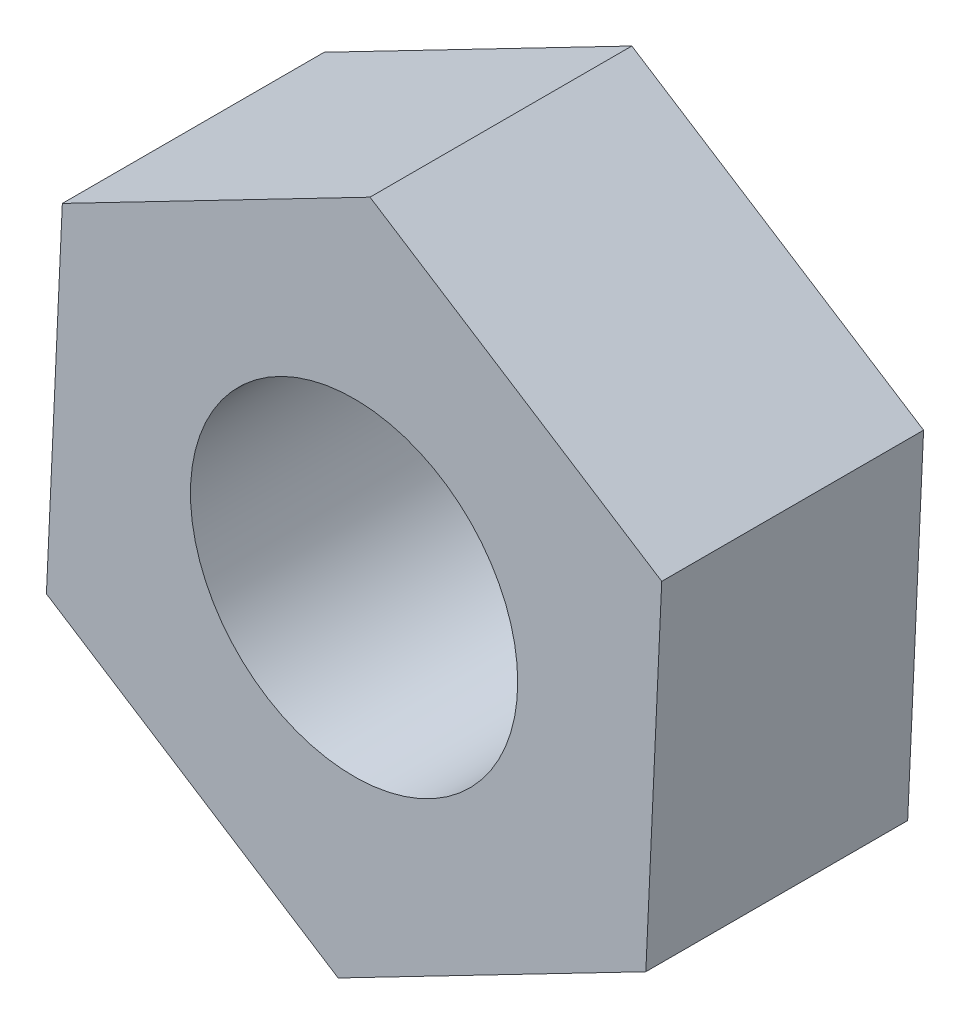
ISO-10303-21;
HEADER;
FILE_DESCRIPTION(('STEP AP214'),'2;1');
FILE_NAME('part.step','',(''),(''),'','','');
FILE_SCHEMA(('AUTOMOTIVE_DESIGN { 1 0 10303 214 1 1 1 1 }'));
ENDSEC;
DATA;
#1=APPLICATION_CONTEXT('core data for automotive mechanical design processes');
#2=APPLICATION_PROTOCOL_DEFINITION('international standard','automotive_design',2000,#1);
#3=PRODUCT_CONTEXT('',#1,'mechanical');
#4=PRODUCT('Part','Part','',(#3));
#5=PRODUCT_RELATED_PRODUCT_CATEGORY('part','',(#4));
#6=PRODUCT_DEFINITION_FORMATION('','',#4);
#7=PRODUCT_DEFINITION_CONTEXT('part definition',#1,'design');
#8=PRODUCT_DEFINITION('design','',#6,#7);
#9=PRODUCT_DEFINITION_SHAPE('','',#8);
#10=(LENGTH_UNIT() NAMED_UNIT(*) SI_UNIT(.MILLI.,.METRE.));
#11=(NAMED_UNIT(*) PLANE_ANGLE_UNIT() SI_UNIT($,.RADIAN.));
#12=(NAMED_UNIT(*) SI_UNIT($,.STERADIAN.) SOLID_ANGLE_UNIT());
#13=UNCERTAINTY_MEASURE_WITH_UNIT(LENGTH_MEASURE(1.E-05),#10,'distance_accuracy_value','');
#14=(GEOMETRIC_REPRESENTATION_CONTEXT(3) GLOBAL_UNCERTAINTY_ASSIGNED_CONTEXT((#13)) GLOBAL_UNIT_ASSIGNED_CONTEXT((#10,
#11,#12)) REPRESENTATION_CONTEXT('',''));
#15=CARTESIAN_POINT('',(0.,0.,0.));
#16=DIRECTION('',(0.,0.,1.));
#17=DIRECTION('',(1.,0.,0.));
#18=AXIS2_PLACEMENT_3D('',#15,#16,#17);
#19=CARTESIAN_POINT('',(0.,0.,2.4));
#20=DIRECTION('',(0.,0.,1.));
#21=DIRECTION('',(1.,0.,0.));
#22=AXIS2_PLACEMENT_3D('',#19,#20,#21);
#23=PLANE('',#22);
#24=DIRECTION('',(-0.0459498793532353,-0.998943746457939,0.));
#25=VECTOR('',#24,1.);
#26=CARTESIAN_POINT('',(-2.67414007092132,1.71239838075906,2.4));
#27=LINE('',#26,#25);
#28=CARTESIAN_POINT('',(-2.67414007092132,1.71239838075906,2.4));
#29=VERTEX_POINT('',#28);
#30=CARTESIAN_POINT('',(-2.82005053459734,-1.45967404431626,2.4));
#31=VERTEX_POINT('',#30);
#32=EDGE_CURVE('E130',#29,#31,#27,.T.);
#33=ORIENTED_EDGE('',*,*,#32,.T.);
#34=DIRECTION('',(0.842135721707559,-0.539265636049701,0.));
#35=VECTOR('',#34,1.);
#36=CARTESIAN_POINT('',(-2.82005053459734,-1.45967404431626,2.4));
#37=LINE('',#36,#35);
#38=CARTESIAN_POINT('',(-0.145910463676016,-3.17207242507531,2.4));
#39=VERTEX_POINT('',#38);
#40=EDGE_CURVE('E88',#31,#39,#37,.T.);
#41=ORIENTED_EDGE('',*,*,#40,.T.);
#42=DIRECTION('',(0.888085601060794,0.459678110408237,0.));
#43=VECTOR('',#42,1.);
#44=CARTESIAN_POINT('',(-0.145910463676016,-3.17207242507531,2.4));
#45=LINE('',#44,#43);
#46=CARTESIAN_POINT('',(2.67414007092132,-1.71239838075906,2.4));
#47=VERTEX_POINT('',#46);
#48=EDGE_CURVE('E101',#39,#47,#45,.T.);
#49=ORIENTED_EDGE('',*,*,#48,.T.);
#50=DIRECTION('',(0.0459498793532356,0.998943746457939,0.));
#51=VECTOR('',#50,1.);
#52=CARTESIAN_POINT('',(2.67414007092132,-1.71239838075906,2.4));
#53=LINE('',#52,#51);
#54=CARTESIAN_POINT('',(2.82005053459734,1.45967404431626,2.4));
#55=VERTEX_POINT('',#54);
#56=EDGE_CURVE('E95',#47,#55,#53,.T.);
#57=ORIENTED_EDGE('',*,*,#56,.T.);
#58=DIRECTION('',(-0.842135721707559,0.539265636049702,0.));
#59=VECTOR('',#58,1.);
#60=CARTESIAN_POINT('',(2.82005053459734,1.45967404431626,2.4));
#61=LINE('',#60,#59);
#62=CARTESIAN_POINT('',(0.145910463676018,3.17207242507531,2.4));
#63=VERTEX_POINT('',#62);
#64=EDGE_CURVE('E99',#55,#63,#61,.T.);
#65=ORIENTED_EDGE('',*,*,#64,.T.);
#66=DIRECTION('',(-0.888085601060795,-0.459678110408237,0.));
#67=VECTOR('',#66,1.);
#68=CARTESIAN_POINT('',(0.145910463676018,3.17207242507531,2.4));
#69=LINE('',#68,#67);
#70=EDGE_CURVE('E51',#63,#29,#69,.T.);
#71=ORIENTED_EDGE('',*,*,#70,.T.);
#72=EDGE_LOOP('',(#33,#41,#49,#57,#65,#71));
#73=FACE_BOUND('',#72,.T.);
#74=CARTESIAN_POINT('',(0.,0.,2.4));
#75=DIRECTION('',(0.,0.,1.));
#76=DIRECTION('',(1.,0.,0.));
#77=AXIS2_PLACEMENT_3D('',#74,#75,#76);
#78=CIRCLE('',#77,1.5);
#79=CARTESIAN_POINT('',(1.5,0.,2.4));
#80=VERTEX_POINT('',#79);
#81=EDGE_CURVE('E123',#80,#80,#78,.T.);
#82=ORIENTED_EDGE('',*,*,#81,.F.);
#83=EDGE_LOOP('',(#82));
#84=FACE_BOUND('',#83,.T.);
#85=ADVANCED_FACE('F34',(#73,#84),#23,.T.);
#86=CARTESIAN_POINT('',(0.,0.,0.));
#87=DIRECTION('',(0.,0.,1.));
#88=DIRECTION('',(1.,0.,0.));
#89=AXIS2_PLACEMENT_3D('',#86,#87,#88);
#90=PLANE('',#89);
#91=DIRECTION('',(-0.0459498793532353,-0.998943746457939,0.));
#92=VECTOR('',#91,1.);
#93=CARTESIAN_POINT('',(-2.67414007092132,1.71239838075906,0.));
#94=LINE('',#93,#92);
#95=CARTESIAN_POINT('',(-2.67414007092132,1.71239838075906,0.));
#96=VERTEX_POINT('',#95);
#97=CARTESIAN_POINT('',(-2.82005053459734,-1.45967404431626,0.));
#98=VERTEX_POINT('',#97);
#99=EDGE_CURVE('E119',#96,#98,#94,.T.);
#100=ORIENTED_EDGE('',*,*,#99,.F.);
#101=DIRECTION('',(-0.888085601060795,-0.459678110408237,0.));
#102=VECTOR('',#101,1.);
#103=CARTESIAN_POINT('',(0.145910463676018,3.17207242507531,0.));
#104=LINE('',#103,#102);
#105=CARTESIAN_POINT('',(0.145910463676018,3.17207242507531,0.));
#106=VERTEX_POINT('',#105);
#107=EDGE_CURVE('E80',#106,#96,#104,.T.);
#108=ORIENTED_EDGE('',*,*,#107,.F.);
#109=DIRECTION('',(-0.842135721707559,0.539265636049702,0.));
#110=VECTOR('',#109,1.);
#111=CARTESIAN_POINT('',(2.82005053459734,1.45967404431626,0.));
#112=LINE('',#111,#110);
#113=CARTESIAN_POINT('',(2.82005053459734,1.45967404431626,0.));
#114=VERTEX_POINT('',#113);
#115=EDGE_CURVE('E74',#114,#106,#112,.T.);
#116=ORIENTED_EDGE('',*,*,#115,.F.);
#117=DIRECTION('',(0.0459498793532356,0.998943746457939,0.));
#118=VECTOR('',#117,1.);
#119=CARTESIAN_POINT('',(2.67414007092132,-1.71239838075906,0.));
#120=LINE('',#119,#118);
#121=CARTESIAN_POINT('',(2.67414007092132,-1.71239838075906,0.));
#122=VERTEX_POINT('',#121);
#123=EDGE_CURVE('E109',#122,#114,#120,.T.);
#124=ORIENTED_EDGE('',*,*,#123,.F.);
#125=DIRECTION('',(0.888085601060794,0.459678110408237,0.));
#126=VECTOR('',#125,1.);
#127=CARTESIAN_POINT('',(-0.145910463676016,-3.17207242507531,0.));
#128=LINE('',#127,#126);
#129=CARTESIAN_POINT('',(-0.145910463676016,-3.17207242507531,0.));
#130=VERTEX_POINT('',#129);
#131=EDGE_CURVE('E125',#130,#122,#128,.T.);
#132=ORIENTED_EDGE('',*,*,#131,.F.);
#133=DIRECTION('',(0.842135721707559,-0.539265636049701,0.));
#134=VECTOR('',#133,1.);
#135=CARTESIAN_POINT('',(-2.82005053459734,-1.45967404431626,0.));
#136=LINE('',#135,#134);
#137=EDGE_CURVE('E122',#98,#130,#136,.T.);
#138=ORIENTED_EDGE('',*,*,#137,.F.);
#139=EDGE_LOOP('',(#100,#108,#116,#124,#132,#138));
#140=FACE_BOUND('',#139,.T.);
#141=CARTESIAN_POINT('',(0.,0.,0.));
#142=DIRECTION('',(0.,0.,1.));
#143=DIRECTION('',(1.,0.,0.));
#144=AXIS2_PLACEMENT_3D('',#141,#142,#143);
#145=CIRCLE('',#144,1.5);
#146=CARTESIAN_POINT('',(1.5,0.,0.));
#147=VERTEX_POINT('',#146);
#148=EDGE_CURVE('E223',#147,#147,#145,.T.);
#149=ORIENTED_EDGE('',*,*,#148,.T.);
#150=EDGE_LOOP('',(#149));
#151=FACE_BOUND('',#150,.T.);
#152=ADVANCED_FACE('F139',(#140,#151),#90,.F.);
#153=CARTESIAN_POINT('',(-2.67414007092132,1.71239838075906,2.4));
#154=DIRECTION('',(0.998943746457939,-0.0459498793532353,0.));
#155=DIRECTION('',(0.0459498793532353,0.998943746457939,0.));
#156=AXIS2_PLACEMENT_3D('',#153,#154,#155);
#157=PLANE('',#156);
#158=ORIENTED_EDGE('',*,*,#99,.T.);
#159=DIRECTION('',(0.,0.,-1.));
#160=VECTOR('',#159,1.);
#161=CARTESIAN_POINT('',(-2.82005053459734,-1.45967404431626,2.4));
#162=LINE('',#161,#160);
#163=EDGE_CURVE('E11',#31,#98,#162,.T.);
#164=ORIENTED_EDGE('',*,*,#163,.F.);
#165=ORIENTED_EDGE('',*,*,#32,.F.);
#166=DIRECTION('',(0.,0.,-1.));
#167=VECTOR('',#166,1.);
#168=CARTESIAN_POINT('',(-2.67414007092132,1.71239838075906,2.4));
#169=LINE('',#168,#167);
#170=EDGE_CURVE('E115',#29,#96,#169,.T.);
#171=ORIENTED_EDGE('',*,*,#170,.T.);
#172=EDGE_LOOP('',(#158,#164,#165,#171));
#173=FACE_BOUND('',#172,.T.);
#174=ADVANCED_FACE('F36',(#173),#157,.F.);
#175=CARTESIAN_POINT('',(-2.82005053459734,-1.45967404431626,2.4));
#176=DIRECTION('',(0.539265636049701,0.842135721707559,0.));
#177=DIRECTION('',(-0.842135721707559,0.539265636049701,0.));
#178=AXIS2_PLACEMENT_3D('',#175,#176,#177);
#179=PLANE('',#178);
#180=ORIENTED_EDGE('',*,*,#137,.T.);
#181=DIRECTION('',(0.,0.,-1.));
#182=VECTOR('',#181,1.);
#183=CARTESIAN_POINT('',(-0.145910463676016,-3.17207242507531,2.4));
#184=LINE('',#183,#182);
#185=EDGE_CURVE('E43',#39,#130,#184,.T.);
#186=ORIENTED_EDGE('',*,*,#185,.F.);
#187=ORIENTED_EDGE('',*,*,#40,.F.);
#188=ORIENTED_EDGE('',*,*,#163,.T.);
#189=EDGE_LOOP('',(#180,#186,#187,#188));
#190=FACE_BOUND('',#189,.T.);
#191=ADVANCED_FACE('F164',(#190),#179,.F.);
#192=CARTESIAN_POINT('',(-0.145910463676016,-3.17207242507531,2.4));
#193=DIRECTION('',(-0.459678110408237,0.888085601060794,0.));
#194=DIRECTION('',(-0.888085601060795,-0.459678110408237,0.));
#195=AXIS2_PLACEMENT_3D('',#192,#193,#194);
#196=PLANE('',#195);
#197=ORIENTED_EDGE('',*,*,#131,.T.);
#198=DIRECTION('',(0.,0.,-1.));
#199=VECTOR('',#198,1.);
#200=CARTESIAN_POINT('',(2.67414007092132,-1.71239838075906,2.4));
#201=LINE('',#200,#199);
#202=EDGE_CURVE('E110',#47,#122,#201,.T.);
#203=ORIENTED_EDGE('',*,*,#202,.F.);
#204=ORIENTED_EDGE('',*,*,#48,.F.);
#205=ORIENTED_EDGE('',*,*,#185,.T.);
#206=EDGE_LOOP('',(#197,#203,#204,#205));
#207=FACE_BOUND('',#206,.T.);
#208=ADVANCED_FACE('F136',(#207),#196,.F.);
#209=CARTESIAN_POINT('',(2.67414007092132,-1.71239838075906,2.4));
#210=DIRECTION('',(-0.998943746457939,0.0459498793532356,0.));
#211=DIRECTION('',(-0.0459498793532356,-0.998943746457939,0.));
#212=AXIS2_PLACEMENT_3D('',#209,#210,#211);
#213=PLANE('',#212);
#214=ORIENTED_EDGE('',*,*,#123,.T.);
#215=DIRECTION('',(0.,0.,-1.));
#216=VECTOR('',#215,1.);
#217=CARTESIAN_POINT('',(2.82005053459734,1.45967404431626,2.4));
#218=LINE('',#217,#216);
#219=EDGE_CURVE('E106',#55,#114,#218,.T.);
#220=ORIENTED_EDGE('',*,*,#219,.F.);
#221=ORIENTED_EDGE('',*,*,#56,.F.);
#222=ORIENTED_EDGE('',*,*,#202,.T.);
#223=EDGE_LOOP('',(#214,#220,#221,#222));
#224=FACE_BOUND('',#223,.T.);
#225=ADVANCED_FACE('F107',(#224),#213,.F.);
#226=CARTESIAN_POINT('',(2.82005053459734,1.45967404431626,2.4));
#227=DIRECTION('',(-0.539265636049702,-0.842135721707559,0.));
#228=DIRECTION('',(0.842135721707559,-0.539265636049702,0.));
#229=AXIS2_PLACEMENT_3D('',#226,#227,#228);
#230=PLANE('',#229);
#231=ORIENTED_EDGE('',*,*,#115,.T.);
#232=DIRECTION('',(0.,0.,-1.));
#233=VECTOR('',#232,1.);
#234=CARTESIAN_POINT('',(0.145910463676018,3.17207242507531,2.4));
#235=LINE('',#234,#233);
#236=EDGE_CURVE('E111',#63,#106,#235,.T.);
#237=ORIENTED_EDGE('',*,*,#236,.F.);
#238=ORIENTED_EDGE('',*,*,#64,.F.);
#239=ORIENTED_EDGE('',*,*,#219,.T.);
#240=EDGE_LOOP('',(#231,#237,#238,#239));
#241=FACE_BOUND('',#240,.T.);
#242=ADVANCED_FACE('F113',(#241),#230,.F.);
#243=CARTESIAN_POINT('',(0.145910463676018,3.17207242507531,2.4));
#244=DIRECTION('',(0.459678110408237,-0.888085601060795,0.));
#245=DIRECTION('',(0.888085601060795,0.459678110408237,0.));
#246=AXIS2_PLACEMENT_3D('',#243,#244,#245);
#247=PLANE('',#246);
#248=ORIENTED_EDGE('',*,*,#107,.T.);
#249=ORIENTED_EDGE('',*,*,#170,.F.);
#250=ORIENTED_EDGE('',*,*,#70,.F.);
#251=ORIENTED_EDGE('',*,*,#236,.T.);
#252=EDGE_LOOP('',(#248,#249,#250,#251));
#253=FACE_BOUND('',#252,.T.);
#254=ADVANCED_FACE('F144',(#253),#247,.F.);
#255=CARTESIAN_POINT('',(0.,0.,2.4));
#256=DIRECTION('',(0.,0.,-1.));
#257=DIRECTION('',(-1.,0.,0.));
#258=AXIS2_PLACEMENT_3D('',#255,#256,#257);
#259=CYLINDRICAL_SURFACE('',#258,1.5);
#260=ORIENTED_EDGE('',*,*,#81,.T.);
#261=EDGE_LOOP('',(#260));
#262=FACE_BOUND('',#261,.T.);
#263=ORIENTED_EDGE('',*,*,#148,.F.);
#264=EDGE_LOOP('',(#263));
#265=FACE_BOUND('',#264,.T.);
#266=ADVANCED_FACE('F146',(#262,#265),#259,.F.);
#267=CLOSED_SHELL('',(#85,#152,#174,#191,#208,#225,#242,#254,#266));
#268=MANIFOLD_SOLID_BREP('B2',#267);
#269=ADVANCED_BREP_SHAPE_REPRESENTATION('',(#18,#268),#14);
#270=SHAPE_DEFINITION_REPRESENTATION(#9,#269);
ENDSEC;
END-ISO-10303-21;
